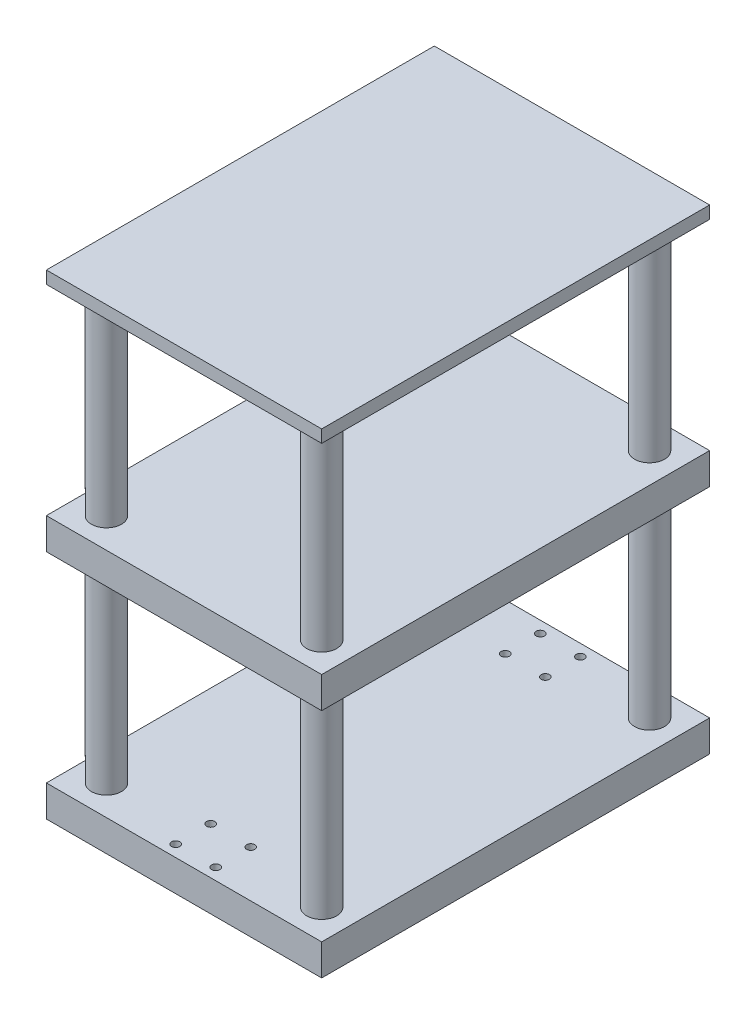
ISO-10303-21;
HEADER;
FILE_DESCRIPTION(('STEP AP214'),'2;1');
FILE_NAME('part.step','',(''),(''),'','','');
FILE_SCHEMA(('AUTOMOTIVE_DESIGN { 1 0 10303 214 1 1 1 1 }'));
ENDSEC;
DATA;
#1=APPLICATION_CONTEXT('core data for automotive mechanical design processes');
#2=APPLICATION_PROTOCOL_DEFINITION('international standard','automotive_design',2000,#1);
#3=PRODUCT_CONTEXT('',#1,'mechanical');
#4=PRODUCT('Part','Part','',(#3));
#5=PRODUCT_RELATED_PRODUCT_CATEGORY('part','',(#4));
#6=PRODUCT_DEFINITION_FORMATION('','',#4);
#7=PRODUCT_DEFINITION_CONTEXT('part definition',#1,'design');
#8=PRODUCT_DEFINITION('design','',#6,#7);
#9=PRODUCT_DEFINITION_SHAPE('','',#8);
#10=(LENGTH_UNIT() NAMED_UNIT(*) SI_UNIT(.MILLI.,.METRE.));
#11=(NAMED_UNIT(*) PLANE_ANGLE_UNIT() SI_UNIT($,.RADIAN.));
#12=(NAMED_UNIT(*) SI_UNIT($,.STERADIAN.) SOLID_ANGLE_UNIT());
#13=UNCERTAINTY_MEASURE_WITH_UNIT(LENGTH_MEASURE(1.E-05),#10,'distance_accuracy_value','');
#14=(GEOMETRIC_REPRESENTATION_CONTEXT(3) GLOBAL_UNCERTAINTY_ASSIGNED_CONTEXT((#13)) GLOBAL_UNIT_ASSIGNED_CONTEXT((#10,
#11,#12)) REPRESENTATION_CONTEXT('',''));
#15=CARTESIAN_POINT('',(0.,0.,0.));
#16=DIRECTION('',(0.,0.,1.));
#17=DIRECTION('',(1.,0.,0.));
#18=AXIS2_PLACEMENT_3D('',#15,#16,#17);
#19=CARTESIAN_POINT('',(55.,-80.,-77.5));
#20=DIRECTION('',(-1.,0.,0.));
#21=DIRECTION('',(0.,0.,1.));
#22=AXIS2_PLACEMENT_3D('',#19,#20,#21);
#23=PLANE('',#22);
#24=DIRECTION('',(0.,0.,-1.));
#25=VECTOR('',#24,1.);
#26=CARTESIAN_POINT('',(55.,-92.5,-77.5));
#27=LINE('',#26,#25);
#28=CARTESIAN_POINT('',(55.,-92.5,77.5));
#29=VERTEX_POINT('',#28);
#30=CARTESIAN_POINT('',(55.,-92.5,-77.5));
#31=VERTEX_POINT('',#30);
#32=EDGE_CURVE('E132',#29,#31,#27,.T.);
#33=ORIENTED_EDGE('',*,*,#32,.T.);
#34=DIRECTION('',(0.,-1.,0.));
#35=VECTOR('',#34,1.);
#36=CARTESIAN_POINT('',(55.,-80.,-77.5));
#37=LINE('',#36,#35);
#38=CARTESIAN_POINT('',(55.,-80.,-77.5));
#39=VERTEX_POINT('',#38);
#40=EDGE_CURVE('E123',#39,#31,#37,.T.);
#41=ORIENTED_EDGE('',*,*,#40,.F.);
#42=DIRECTION('',(0.,0.,-1.));
#43=VECTOR('',#42,1.);
#44=CARTESIAN_POINT('',(55.,-80.,-77.5));
#45=LINE('',#44,#43);
#46=CARTESIAN_POINT('',(55.,-80.,77.5));
#47=VERTEX_POINT('',#46);
#48=EDGE_CURVE('E117',#47,#39,#45,.T.);
#49=ORIENTED_EDGE('',*,*,#48,.F.);
#50=DIRECTION('',(0.,-1.,0.));
#51=VECTOR('',#50,1.);
#52=CARTESIAN_POINT('',(55.,-80.,77.5));
#53=LINE('',#52,#51);
#54=EDGE_CURVE('E128',#47,#29,#53,.T.);
#55=ORIENTED_EDGE('',*,*,#54,.T.);
#56=EDGE_LOOP('',(#33,#41,#49,#55));
#57=FACE_BOUND('',#56,.T.);
#58=ADVANCED_FACE('F62',(#57),#23,.F.);
#59=CARTESIAN_POINT('',(-55.,-80.,-77.5));
#60=DIRECTION('',(0.,0.,1.));
#61=DIRECTION('',(1.,0.,0.));
#62=AXIS2_PLACEMENT_3D('',#59,#60,#61);
#63=PLANE('',#62);
#64=DIRECTION('',(-1.,0.,0.));
#65=VECTOR('',#64,1.);
#66=CARTESIAN_POINT('',(-55.,-92.5,-77.5));
#67=LINE('',#66,#65);
#68=CARTESIAN_POINT('',(-55.,-92.5,-77.5));
#69=VERTEX_POINT('',#68);
#70=EDGE_CURVE('E122',#31,#69,#67,.T.);
#71=ORIENTED_EDGE('',*,*,#70,.T.);
#72=DIRECTION('',(0.,-1.,0.));
#73=VECTOR('',#72,1.);
#74=CARTESIAN_POINT('',(-55.,-80.,-77.5));
#75=LINE('',#74,#73);
#76=CARTESIAN_POINT('',(-55.,-80.,-77.5));
#77=VERTEX_POINT('',#76);
#78=EDGE_CURVE('E120',#77,#69,#75,.T.);
#79=ORIENTED_EDGE('',*,*,#78,.F.);
#80=DIRECTION('',(-1.,0.,0.));
#81=VECTOR('',#80,1.);
#82=CARTESIAN_POINT('',(-55.,-80.,-77.5));
#83=LINE('',#82,#81);
#84=EDGE_CURVE('E112',#39,#77,#83,.T.);
#85=ORIENTED_EDGE('',*,*,#84,.F.);
#86=ORIENTED_EDGE('',*,*,#40,.T.);
#87=EDGE_LOOP('',(#71,#79,#85,#86));
#88=FACE_BOUND('',#87,.T.);
#89=ADVANCED_FACE('F121',(#88),#63,.F.);
#90=CARTESIAN_POINT('',(-55.,-80.,-77.5));
#91=DIRECTION('',(1.,0.,0.));
#92=DIRECTION('',(0.,0.,-1.));
#93=AXIS2_PLACEMENT_3D('',#90,#91,#92);
#94=PLANE('',#93);
#95=DIRECTION('',(0.,0.,1.));
#96=VECTOR('',#95,1.);
#97=CARTESIAN_POINT('',(-55.,-92.5,-77.5));
#98=LINE('',#97,#96);
#99=CARTESIAN_POINT('',(-55.,-92.5,77.5));
#100=VERTEX_POINT('',#99);
#101=EDGE_CURVE('E98',#69,#100,#98,.T.);
#102=ORIENTED_EDGE('',*,*,#101,.T.);
#103=DIRECTION('',(0.,-1.,0.));
#104=VECTOR('',#103,1.);
#105=CARTESIAN_POINT('',(-55.,-80.,77.5));
#106=LINE('',#105,#104);
#107=CARTESIAN_POINT('',(-55.,-80.,77.5));
#108=VERTEX_POINT('',#107);
#109=EDGE_CURVE('E124',#108,#100,#106,.T.);
#110=ORIENTED_EDGE('',*,*,#109,.F.);
#111=DIRECTION('',(0.,0.,1.));
#112=VECTOR('',#111,1.);
#113=CARTESIAN_POINT('',(-55.,-80.,-77.5));
#114=LINE('',#113,#112);
#115=EDGE_CURVE('E115',#77,#108,#114,.T.);
#116=ORIENTED_EDGE('',*,*,#115,.F.);
#117=ORIENTED_EDGE('',*,*,#78,.T.);
#118=EDGE_LOOP('',(#102,#110,#116,#117));
#119=FACE_BOUND('',#118,.T.);
#120=ADVANCED_FACE('F126',(#119),#94,.F.);
#121=CARTESIAN_POINT('',(-55.,-80.,77.5));
#122=DIRECTION('',(0.,0.,-1.));
#123=DIRECTION('',(-1.,0.,0.));
#124=AXIS2_PLACEMENT_3D('',#121,#122,#123);
#125=PLANE('',#124);
#126=DIRECTION('',(1.,0.,0.));
#127=VECTOR('',#126,1.);
#128=CARTESIAN_POINT('',(-55.,-92.5,77.5));
#129=LINE('',#128,#127);
#130=EDGE_CURVE('E104',#100,#29,#129,.T.);
#131=ORIENTED_EDGE('',*,*,#130,.T.);
#132=ORIENTED_EDGE('',*,*,#54,.F.);
#133=DIRECTION('',(1.,0.,0.));
#134=VECTOR('',#133,1.);
#135=CARTESIAN_POINT('',(-55.,-80.,77.5));
#136=LINE('',#135,#134);
#137=EDGE_CURVE('E81',#108,#47,#136,.T.);
#138=ORIENTED_EDGE('',*,*,#137,.F.);
#139=ORIENTED_EDGE('',*,*,#109,.T.);
#140=EDGE_LOOP('',(#131,#132,#138,#139));
#141=FACE_BOUND('',#140,.T.);
#142=ADVANCED_FACE('F203',(#141),#125,.F.);
#143=CARTESIAN_POINT('',(0.,-80.,0.));
#144=DIRECTION('',(0.,1.,0.));
#145=DIRECTION('',(0.,0.,1.));
#146=AXIS2_PLACEMENT_3D('',#143,#144,#145);
#147=PLANE('',#146);
#148=CARTESIAN_POINT('',(8.,-80.,-58.85));
#149=DIRECTION('',(0.,1.,0.));
#150=DIRECTION('',(0.,0.,1.));
#151=AXIS2_PLACEMENT_3D('',#148,#149,#150);
#152=CIRCLE('',#151,1.64999999999999);
#153=CARTESIAN_POINT('',(8.,-80.,-57.2));
#154=VERTEX_POINT('',#153);
#155=EDGE_CURVE('E422',#154,#154,#152,.T.);
#156=ORIENTED_EDGE('',*,*,#155,.F.);
#157=EDGE_LOOP('',(#156));
#158=FACE_BOUND('',#157,.T.);
#159=CARTESIAN_POINT('',(-8.,-80.,-58.85));
#160=DIRECTION('',(0.,1.,0.));
#161=DIRECTION('',(0.,0.,1.));
#162=AXIS2_PLACEMENT_3D('',#159,#160,#161);
#163=CIRCLE('',#162,1.64999999999999);
#164=CARTESIAN_POINT('',(-8.,-80.,-57.2));
#165=VERTEX_POINT('',#164);
#166=EDGE_CURVE('E65',#165,#165,#163,.T.);
#167=ORIENTED_EDGE('',*,*,#166,.F.);
#168=EDGE_LOOP('',(#167));
#169=FACE_BOUND('',#168,.T.);
#170=CARTESIAN_POINT('',(8.,-80.,-72.85));
#171=DIRECTION('',(0.,1.,0.));
#172=DIRECTION('',(0.,0.,1.));
#173=AXIS2_PLACEMENT_3D('',#170,#171,#172);
#174=CIRCLE('',#173,1.64999999999999);
#175=CARTESIAN_POINT('',(8.,-80.,-71.2));
#176=VERTEX_POINT('',#175);
#177=EDGE_CURVE('E437',#176,#176,#174,.T.);
#178=ORIENTED_EDGE('',*,*,#177,.F.);
#179=EDGE_LOOP('',(#178));
#180=FACE_BOUND('',#179,.T.);
#181=CARTESIAN_POINT('',(-8.,-80.,-72.85));
#182=DIRECTION('',(0.,1.,0.));
#183=DIRECTION('',(0.,0.,1.));
#184=AXIS2_PLACEMENT_3D('',#181,#182,#183);
#185=CIRCLE('',#184,1.64999999999999);
#186=CARTESIAN_POINT('',(-8.,-80.,-71.2));
#187=VERTEX_POINT('',#186);
#188=EDGE_CURVE('E161',#187,#187,#185,.T.);
#189=ORIENTED_EDGE('',*,*,#188,.F.);
#190=EDGE_LOOP('',(#189));
#191=FACE_BOUND('',#190,.T.);
#192=CARTESIAN_POINT('',(-8.,-80.,58.85));
#193=DIRECTION('',(0.,1.,0.));
#194=DIRECTION('',(0.,0.,1.));
#195=AXIS2_PLACEMENT_3D('',#192,#193,#194);
#196=CIRCLE('',#195,1.64999999999999);
#197=CARTESIAN_POINT('',(-8.,-80.,60.5));
#198=VERTEX_POINT('',#197);
#199=EDGE_CURVE('E154',#198,#198,#196,.T.);
#200=ORIENTED_EDGE('',*,*,#199,.F.);
#201=EDGE_LOOP('',(#200));
#202=FACE_BOUND('',#201,.T.);
#203=CARTESIAN_POINT('',(8.,-80.,58.85));
#204=DIRECTION('',(0.,1.,0.));
#205=DIRECTION('',(0.,0.,1.));
#206=AXIS2_PLACEMENT_3D('',#203,#204,#205);
#207=CIRCLE('',#206,1.64999999999999);
#208=CARTESIAN_POINT('',(8.,-80.,60.5));
#209=VERTEX_POINT('',#208);
#210=EDGE_CURVE('E165',#209,#209,#207,.T.);
#211=ORIENTED_EDGE('',*,*,#210,.F.);
#212=EDGE_LOOP('',(#211));
#213=FACE_BOUND('',#212,.T.);
#214=CARTESIAN_POINT('',(8.,-80.,72.85));
#215=DIRECTION('',(0.,1.,0.));
#216=DIRECTION('',(0.,0.,1.));
#217=AXIS2_PLACEMENT_3D('',#214,#215,#216);
#218=CIRCLE('',#217,1.64999999999999);
#219=CARTESIAN_POINT('',(8.,-80.,74.5));
#220=VERTEX_POINT('',#219);
#221=EDGE_CURVE('E175',#220,#220,#218,.T.);
#222=ORIENTED_EDGE('',*,*,#221,.F.);
#223=EDGE_LOOP('',(#222));
#224=FACE_BOUND('',#223,.T.);
#225=CARTESIAN_POINT('',(-8.,-80.,72.85));
#226=DIRECTION('',(0.,1.,0.));
#227=DIRECTION('',(0.,0.,1.));
#228=AXIS2_PLACEMENT_3D('',#225,#226,#227);
#229=CIRCLE('',#228,1.64999999999999);
#230=CARTESIAN_POINT('',(-8.,-80.,74.5));
#231=VERTEX_POINT('',#230);
#232=EDGE_CURVE('E143',#231,#231,#229,.T.);
#233=ORIENTED_EDGE('',*,*,#232,.F.);
#234=EDGE_LOOP('',(#233));
#235=FACE_BOUND('',#234,.T.);
#236=CARTESIAN_POINT('',(43.,-80.,65.5));
#237=DIRECTION('',(0.,1.,0.));
#238=DIRECTION('',(0.,0.,-1.));
#239=AXIS2_PLACEMENT_3D('',#236,#237,#238);
#240=CIRCLE('',#239,6.);
#241=CARTESIAN_POINT('',(43.,-80.,59.5));
#242=VERTEX_POINT('',#241);
#243=EDGE_CURVE('E147',#242,#242,#240,.T.);
#244=ORIENTED_EDGE('',*,*,#243,.F.);
#245=EDGE_LOOP('',(#244));
#246=FACE_BOUND('',#245,.T.);
#247=CARTESIAN_POINT('',(43.,-80.,-65.5));
#248=DIRECTION('',(0.,1.,0.));
#249=DIRECTION('',(0.,0.,1.));
#250=AXIS2_PLACEMENT_3D('',#247,#248,#249);
#251=CIRCLE('',#250,6.);
#252=CARTESIAN_POINT('',(43.,-80.,-59.5));
#253=VERTEX_POINT('',#252);
#254=EDGE_CURVE('E13',#253,#253,#251,.T.);
#255=ORIENTED_EDGE('',*,*,#254,.F.);
#256=EDGE_LOOP('',(#255));
#257=FACE_BOUND('',#256,.T.);
#258=CARTESIAN_POINT('',(-43.,-80.,65.5));
#259=DIRECTION('',(0.,1.,0.));
#260=DIRECTION('',(0.,0.,1.));
#261=AXIS2_PLACEMENT_3D('',#258,#259,#260);
#262=CIRCLE('',#261,6.);
#263=CARTESIAN_POINT('',(-43.,-80.,71.5));
#264=VERTEX_POINT('',#263);
#265=EDGE_CURVE('E72',#264,#264,#262,.T.);
#266=ORIENTED_EDGE('',*,*,#265,.F.);
#267=EDGE_LOOP('',(#266));
#268=FACE_BOUND('',#267,.T.);
#269=CARTESIAN_POINT('',(-43.,-80.,-65.5));
#270=DIRECTION('',(0.,1.,0.));
#271=DIRECTION('',(0.,0.,1.));
#272=AXIS2_PLACEMENT_3D('',#269,#270,#271);
#273=CIRCLE('',#272,6.);
#274=CARTESIAN_POINT('',(-43.,-80.,-59.5));
#275=VERTEX_POINT('',#274);
#276=EDGE_CURVE('E193',#275,#275,#273,.T.);
#277=ORIENTED_EDGE('',*,*,#276,.F.);
#278=EDGE_LOOP('',(#277));
#279=FACE_BOUND('',#278,.T.);
#280=ORIENTED_EDGE('',*,*,#48,.T.);
#281=ORIENTED_EDGE('',*,*,#84,.T.);
#282=ORIENTED_EDGE('',*,*,#115,.T.);
#283=ORIENTED_EDGE('',*,*,#137,.T.);
#284=EDGE_LOOP('',(#280,#281,#282,#283));
#285=FACE_BOUND('',#284,.T.);
#286=ADVANCED_FACE('F113',(#158,#169,#180,#191,#202,#213,#224,#235,#246,#257,#268,#279,#285),
#147,.T.);
#287=CARTESIAN_POINT('',(0.,-92.5,0.));
#288=DIRECTION('',(0.,1.,0.));
#289=DIRECTION('',(0.,0.,1.));
#290=AXIS2_PLACEMENT_3D('',#287,#288,#289);
#291=PLANE('',#290);
#292=CARTESIAN_POINT('',(8.,-92.5,-58.85));
#293=DIRECTION('',(0.,-1.,0.));
#294=DIRECTION('',(0.,0.,-1.));
#295=AXIS2_PLACEMENT_3D('',#292,#293,#294);
#296=CIRCLE('',#295,1.64999999999999);
#297=CARTESIAN_POINT('',(8.,-92.5,-60.5));
#298=VERTEX_POINT('',#297);
#299=EDGE_CURVE('E425',#298,#298,#296,.T.);
#300=ORIENTED_EDGE('',*,*,#299,.F.);
#301=EDGE_LOOP('',(#300));
#302=FACE_BOUND('',#301,.T.);
#303=CARTESIAN_POINT('',(-8.,-92.5,-58.85));
#304=DIRECTION('',(0.,-1.,0.));
#305=DIRECTION('',(0.,0.,-1.));
#306=AXIS2_PLACEMENT_3D('',#303,#304,#305);
#307=CIRCLE('',#306,1.64999999999999);
#308=CARTESIAN_POINT('',(-8.,-92.5,-60.5));
#309=VERTEX_POINT('',#308);
#310=EDGE_CURVE('E428',#309,#309,#307,.T.);
#311=ORIENTED_EDGE('',*,*,#310,.F.);
#312=EDGE_LOOP('',(#311));
#313=FACE_BOUND('',#312,.T.);
#314=CARTESIAN_POINT('',(8.,-92.5,-72.85));
#315=DIRECTION('',(0.,-1.,0.));
#316=DIRECTION('',(0.,0.,-1.));
#317=AXIS2_PLACEMENT_3D('',#314,#315,#316);
#318=CIRCLE('',#317,1.64999999999999);
#319=CARTESIAN_POINT('',(8.,-92.5,-74.5));
#320=VERTEX_POINT('',#319);
#321=EDGE_CURVE('E442',#320,#320,#318,.T.);
#322=ORIENTED_EDGE('',*,*,#321,.F.);
#323=EDGE_LOOP('',(#322));
#324=FACE_BOUND('',#323,.T.);
#325=CARTESIAN_POINT('',(-8.,-92.5,-72.85));
#326=DIRECTION('',(0.,-1.,0.));
#327=DIRECTION('',(0.,0.,-1.));
#328=AXIS2_PLACEMENT_3D('',#325,#326,#327);
#329=CIRCLE('',#328,1.64999999999999);
#330=CARTESIAN_POINT('',(-8.,-92.5,-74.5));
#331=VERTEX_POINT('',#330);
#332=EDGE_CURVE('E441',#331,#331,#329,.T.);
#333=ORIENTED_EDGE('',*,*,#332,.F.);
#334=EDGE_LOOP('',(#333));
#335=FACE_BOUND('',#334,.T.);
#336=CARTESIAN_POINT('',(-8.,-92.5,58.85));
#337=DIRECTION('',(0.,-1.,0.));
#338=DIRECTION('',(0.,0.,-1.));
#339=AXIS2_PLACEMENT_3D('',#336,#337,#338);
#340=CIRCLE('',#339,1.64999999999999);
#341=CARTESIAN_POINT('',(-8.,-92.5,57.2));
#342=VERTEX_POINT('',#341);
#343=EDGE_CURVE('E160',#342,#342,#340,.T.);
#344=ORIENTED_EDGE('',*,*,#343,.F.);
#345=EDGE_LOOP('',(#344));
#346=FACE_BOUND('',#345,.T.);
#347=CARTESIAN_POINT('',(8.,-92.5,58.85));
#348=DIRECTION('',(0.,-1.,0.));
#349=DIRECTION('',(0.,0.,-1.));
#350=AXIS2_PLACEMENT_3D('',#347,#348,#349);
#351=CIRCLE('',#350,1.64999999999999);
#352=CARTESIAN_POINT('',(8.,-92.5,57.2));
#353=VERTEX_POINT('',#352);
#354=EDGE_CURVE('E170',#353,#353,#351,.T.);
#355=ORIENTED_EDGE('',*,*,#354,.F.);
#356=EDGE_LOOP('',(#355));
#357=FACE_BOUND('',#356,.T.);
#358=CARTESIAN_POINT('',(8.,-92.5,72.85));
#359=DIRECTION('',(0.,-1.,0.));
#360=DIRECTION('',(0.,0.,-1.));
#361=AXIS2_PLACEMENT_3D('',#358,#359,#360);
#362=CIRCLE('',#361,1.64999999999999);
#363=CARTESIAN_POINT('',(8.,-92.5,71.2));
#364=VERTEX_POINT('',#363);
#365=EDGE_CURVE('E173',#364,#364,#362,.T.);
#366=ORIENTED_EDGE('',*,*,#365,.F.);
#367=EDGE_LOOP('',(#366));
#368=FACE_BOUND('',#367,.T.);
#369=CARTESIAN_POINT('',(-8.,-92.5,72.85));
#370=DIRECTION('',(0.,-1.,0.));
#371=DIRECTION('',(0.,0.,-1.));
#372=AXIS2_PLACEMENT_3D('',#369,#370,#371);
#373=CIRCLE('',#372,1.64999999999999);
#374=CARTESIAN_POINT('',(-8.,-92.5,71.2));
#375=VERTEX_POINT('',#374);
#376=EDGE_CURVE('E148',#375,#375,#373,.T.);
#377=ORIENTED_EDGE('',*,*,#376,.F.);
#378=EDGE_LOOP('',(#377));
#379=FACE_BOUND('',#378,.T.);
#380=ORIENTED_EDGE('',*,*,#32,.F.);
#381=ORIENTED_EDGE('',*,*,#130,.F.);
#382=ORIENTED_EDGE('',*,*,#101,.F.);
#383=ORIENTED_EDGE('',*,*,#70,.F.);
#384=EDGE_LOOP('',(#380,#381,#382,#383));
#385=FACE_BOUND('',#384,.T.);
#386=ADVANCED_FACE('F202',(#302,#313,#324,#335,#346,#357,#368,#379,#385),#291,.F.);
#387=CARTESIAN_POINT('',(-43.,0.,-65.5));
#388=DIRECTION('',(0.,-1.,0.));
#389=DIRECTION('',(0.,0.,-1.));
#390=AXIS2_PLACEMENT_3D('',#387,#388,#389);
#391=CYLINDRICAL_SURFACE('',#390,6.);
#392=CARTESIAN_POINT('',(-43.,0.,-65.5));
#393=DIRECTION('',(0.,1.,0.));
#394=DIRECTION('',(0.,0.,1.));
#395=AXIS2_PLACEMENT_3D('',#392,#393,#394);
#396=CIRCLE('',#395,6.);
#397=CARTESIAN_POINT('',(-43.,0.,-59.5));
#398=VERTEX_POINT('',#397);
#399=EDGE_CURVE('E135',#398,#398,#396,.T.);
#400=ORIENTED_EDGE('',*,*,#399,.F.);
#401=EDGE_LOOP('',(#400));
#402=FACE_BOUND('',#401,.T.);
#403=ORIENTED_EDGE('',*,*,#276,.T.);
#404=EDGE_LOOP('',(#403));
#405=FACE_BOUND('',#404,.T.);
#406=ADVANCED_FACE('F199',(#402,#405),#391,.T.);
#407=CARTESIAN_POINT('',(-43.,0.,-65.5));
#408=DIRECTION('',(0.,1.,0.));
#409=DIRECTION('',(0.,0.,1.));
#410=AXIS2_PLACEMENT_3D('',#407,#408,#409);
#411=PLANE('',#410);
#412=ORIENTED_EDGE('',*,*,#399,.T.);
#413=EDGE_LOOP('',(#412));
#414=FACE_BOUND('',#413,.T.);
#415=ADVANCED_FACE('F242',(#414),#411,.T.);
#416=CARTESIAN_POINT('',(-43.,0.,65.5));
#417=DIRECTION('',(0.,-1.,0.));
#418=DIRECTION('',(0.,0.,-1.));
#419=AXIS2_PLACEMENT_3D('',#416,#417,#418);
#420=CYLINDRICAL_SURFACE('',#419,6.);
#421=CARTESIAN_POINT('',(-43.,0.,65.5));
#422=DIRECTION('',(0.,-1.,0.));
#423=DIRECTION('',(0.,0.,-1.));
#424=AXIS2_PLACEMENT_3D('',#421,#422,#423);
#425=CIRCLE('',#424,6.);
#426=CARTESIAN_POINT('',(-43.,0.,59.5));
#427=VERTEX_POINT('',#426);
#428=EDGE_CURVE('E190',#427,#427,#425,.T.);
#429=ORIENTED_EDGE('',*,*,#428,.T.);
#430=EDGE_LOOP('',(#429));
#431=FACE_BOUND('',#430,.T.);
#432=ORIENTED_EDGE('',*,*,#265,.T.);
#433=EDGE_LOOP('',(#432));
#434=FACE_BOUND('',#433,.T.);
#435=ADVANCED_FACE('F251',(#431,#434),#420,.T.);
#436=CARTESIAN_POINT('',(-43.,0.,65.5));
#437=DIRECTION('',(0.,1.,0.));
#438=DIRECTION('',(0.,0.,-1.));
#439=AXIS2_PLACEMENT_3D('',#436,#437,#438);
#440=PLANE('',#439);
#441=ORIENTED_EDGE('',*,*,#428,.F.);
#442=EDGE_LOOP('',(#441));
#443=FACE_BOUND('',#442,.T.);
#444=ADVANCED_FACE('F261',(#443),#440,.T.);
#445=CARTESIAN_POINT('',(43.,0.,-65.5));
#446=DIRECTION('',(0.,-1.,0.));
#447=DIRECTION('',(0.,0.,-1.));
#448=AXIS2_PLACEMENT_3D('',#445,#446,#447);
#449=CYLINDRICAL_SURFACE('',#448,6.);
#450=CARTESIAN_POINT('',(43.,0.,-65.5));
#451=DIRECTION('',(0.,-1.,0.));
#452=DIRECTION('',(0.,0.,1.));
#453=AXIS2_PLACEMENT_3D('',#450,#451,#452);
#454=CIRCLE('',#453,6.);
#455=CARTESIAN_POINT('',(43.,0.,-59.5));
#456=VERTEX_POINT('',#455);
#457=EDGE_CURVE('E185',#456,#456,#454,.T.);
#458=ORIENTED_EDGE('',*,*,#457,.T.);
#459=EDGE_LOOP('',(#458));
#460=FACE_BOUND('',#459,.T.);
#461=ORIENTED_EDGE('',*,*,#254,.T.);
#462=EDGE_LOOP('',(#461));
#463=FACE_BOUND('',#462,.T.);
#464=ADVANCED_FACE('F270',(#460,#463),#449,.T.);
#465=CARTESIAN_POINT('',(43.,0.,-65.5));
#466=DIRECTION('',(0.,1.,0.));
#467=DIRECTION('',(0.,0.,1.));
#468=AXIS2_PLACEMENT_3D('',#465,#466,#467);
#469=PLANE('',#468);
#470=ORIENTED_EDGE('',*,*,#457,.F.);
#471=EDGE_LOOP('',(#470));
#472=FACE_BOUND('',#471,.T.);
#473=ADVANCED_FACE('F280',(#472),#469,.T.);
#474=CARTESIAN_POINT('',(43.,0.,65.5));
#475=DIRECTION('',(0.,-1.,0.));
#476=DIRECTION('',(0.,0.,-1.));
#477=AXIS2_PLACEMENT_3D('',#474,#475,#476);
#478=CYLINDRICAL_SURFACE('',#477,6.);
#479=CARTESIAN_POINT('',(43.,0.,65.5));
#480=DIRECTION('',(0.,1.,0.));
#481=DIRECTION('',(0.,0.,-1.));
#482=AXIS2_PLACEMENT_3D('',#479,#480,#481);
#483=CIRCLE('',#482,6.);
#484=CARTESIAN_POINT('',(43.,0.,59.5));
#485=VERTEX_POINT('',#484);
#486=EDGE_CURVE('E182',#485,#485,#483,.T.);
#487=ORIENTED_EDGE('',*,*,#486,.F.);
#488=EDGE_LOOP('',(#487));
#489=FACE_BOUND('',#488,.T.);
#490=ORIENTED_EDGE('',*,*,#243,.T.);
#491=EDGE_LOOP('',(#490));
#492=FACE_BOUND('',#491,.T.);
#493=ADVANCED_FACE('F289',(#489,#492),#478,.T.);
#494=CARTESIAN_POINT('',(43.,0.,65.5));
#495=DIRECTION('',(0.,1.,0.));
#496=DIRECTION('',(0.,0.,-1.));
#497=AXIS2_PLACEMENT_3D('',#494,#495,#496);
#498=PLANE('',#497);
#499=ORIENTED_EDGE('',*,*,#486,.T.);
#500=EDGE_LOOP('',(#499));
#501=FACE_BOUND('',#500,.T.);
#502=ADVANCED_FACE('F299',(#501),#498,.T.);
#503=CARTESIAN_POINT('',(-8.,-92.5,72.85));
#504=DIRECTION('',(0.,-1.,0.));
#505=DIRECTION('',(0.,0.,-1.));
#506=AXIS2_PLACEMENT_3D('',#503,#504,#505);
#507=CYLINDRICAL_SURFACE('',#506,1.64999999999999);
#508=ORIENTED_EDGE('',*,*,#232,.T.);
#509=EDGE_LOOP('',(#508));
#510=FACE_BOUND('',#509,.T.);
#511=ORIENTED_EDGE('',*,*,#376,.T.);
#512=EDGE_LOOP('',(#511));
#513=FACE_BOUND('',#512,.T.);
#514=ADVANCED_FACE('F308',(#510,#513),#507,.F.);
#515=CARTESIAN_POINT('',(8.,-92.5,72.85));
#516=DIRECTION('',(0.,-1.,0.));
#517=DIRECTION('',(0.,0.,-1.));
#518=AXIS2_PLACEMENT_3D('',#515,#516,#517);
#519=CYLINDRICAL_SURFACE('',#518,1.64999999999999);
#520=ORIENTED_EDGE('',*,*,#221,.T.);
#521=EDGE_LOOP('',(#520));
#522=FACE_BOUND('',#521,.T.);
#523=ORIENTED_EDGE('',*,*,#365,.T.);
#524=EDGE_LOOP('',(#523));
#525=FACE_BOUND('',#524,.T.);
#526=ADVANCED_FACE('F317',(#522,#525),#519,.F.);
#527=CARTESIAN_POINT('',(8.,-92.5,58.85));
#528=DIRECTION('',(0.,-1.,0.));
#529=DIRECTION('',(0.,0.,-1.));
#530=AXIS2_PLACEMENT_3D('',#527,#528,#529);
#531=CYLINDRICAL_SURFACE('',#530,1.64999999999999);
#532=ORIENTED_EDGE('',*,*,#210,.T.);
#533=EDGE_LOOP('',(#532));
#534=FACE_BOUND('',#533,.T.);
#535=ORIENTED_EDGE('',*,*,#354,.T.);
#536=EDGE_LOOP('',(#535));
#537=FACE_BOUND('',#536,.T.);
#538=ADVANCED_FACE('F326',(#534,#537),#531,.F.);
#539=CARTESIAN_POINT('',(-8.,-92.5,58.85));
#540=DIRECTION('',(0.,-1.,0.));
#541=DIRECTION('',(0.,0.,-1.));
#542=AXIS2_PLACEMENT_3D('',#539,#540,#541);
#543=CYLINDRICAL_SURFACE('',#542,1.64999999999999);
#544=ORIENTED_EDGE('',*,*,#199,.T.);
#545=EDGE_LOOP('',(#544));
#546=FACE_BOUND('',#545,.T.);
#547=ORIENTED_EDGE('',*,*,#343,.T.);
#548=EDGE_LOOP('',(#547));
#549=FACE_BOUND('',#548,.T.);
#550=ADVANCED_FACE('F335',(#546,#549),#543,.F.);
#551=CARTESIAN_POINT('',(-8.,-92.5,-72.85));
#552=DIRECTION('',(0.,-1.,0.));
#553=DIRECTION('',(0.,0.,-1.));
#554=AXIS2_PLACEMENT_3D('',#551,#552,#553);
#555=CYLINDRICAL_SURFACE('',#554,1.64999999999999);
#556=ORIENTED_EDGE('',*,*,#188,.T.);
#557=EDGE_LOOP('',(#556));
#558=FACE_BOUND('',#557,.T.);
#559=ORIENTED_EDGE('',*,*,#332,.T.);
#560=EDGE_LOOP('',(#559));
#561=FACE_BOUND('',#560,.T.);
#562=ADVANCED_FACE('F343',(#558,#561),#555,.F.);
#563=CARTESIAN_POINT('',(8.,-92.5,-72.85));
#564=DIRECTION('',(0.,-1.,0.));
#565=DIRECTION('',(0.,0.,-1.));
#566=AXIS2_PLACEMENT_3D('',#563,#564,#565);
#567=CYLINDRICAL_SURFACE('',#566,1.64999999999999);
#568=ORIENTED_EDGE('',*,*,#177,.T.);
#569=EDGE_LOOP('',(#568));
#570=FACE_BOUND('',#569,.T.);
#571=ORIENTED_EDGE('',*,*,#321,.T.);
#572=EDGE_LOOP('',(#571));
#573=FACE_BOUND('',#572,.T.);
#574=ADVANCED_FACE('F361',(#570,#573),#567,.F.);
#575=CARTESIAN_POINT('',(-8.,-92.5,-58.85));
#576=DIRECTION('',(0.,-1.,0.));
#577=DIRECTION('',(0.,0.,-1.));
#578=AXIS2_PLACEMENT_3D('',#575,#576,#577);
#579=CYLINDRICAL_SURFACE('',#578,1.64999999999999);
#580=ORIENTED_EDGE('',*,*,#166,.T.);
#581=EDGE_LOOP('',(#580));
#582=FACE_BOUND('',#581,.T.);
#583=ORIENTED_EDGE('',*,*,#310,.T.);
#584=EDGE_LOOP('',(#583));
#585=FACE_BOUND('',#584,.T.);
#586=ADVANCED_FACE('F370',(#582,#585),#579,.F.);
#587=CARTESIAN_POINT('',(8.,-92.5,-58.85));
#588=DIRECTION('',(0.,-1.,0.));
#589=DIRECTION('',(0.,0.,-1.));
#590=AXIS2_PLACEMENT_3D('',#587,#588,#589);
#591=CYLINDRICAL_SURFACE('',#590,1.64999999999999);
#592=ORIENTED_EDGE('',*,*,#155,.T.);
#593=EDGE_LOOP('',(#592));
#594=FACE_BOUND('',#593,.T.);
#595=ORIENTED_EDGE('',*,*,#299,.T.);
#596=EDGE_LOOP('',(#595));
#597=FACE_BOUND('',#596,.T.);
#598=ADVANCED_FACE('F379',(#594,#597),#591,.F.);
#599=CLOSED_SHELL('',(#58,#89,#120,#142,#286,#386,#406,#415,#435,#444,#464,#473,#493,#502,#514,
#526,#538,#550,#562,#574,#586,#598));
#600=MANIFOLD_SOLID_BREP('B2',#599);
#601=CARTESIAN_POINT('',(55.,12.5,-77.5));
#602=DIRECTION('',(-1.,0.,0.));
#603=DIRECTION('',(0.,0.,1.));
#604=AXIS2_PLACEMENT_3D('',#601,#602,#603);
#605=PLANE('',#604);
#606=DIRECTION('',(0.,0.,-1.));
#607=VECTOR('',#606,1.);
#608=CARTESIAN_POINT('',(55.,0.,-77.5));
#609=LINE('',#608,#607);
#610=CARTESIAN_POINT('',(55.,0.,77.5));
#611=VERTEX_POINT('',#610);
#612=CARTESIAN_POINT('',(55.,0.,-77.5));
#613=VERTEX_POINT('',#612);
#614=EDGE_CURVE('E621',#611,#613,#609,.T.);
#615=ORIENTED_EDGE('',*,*,#614,.T.);
#616=DIRECTION('',(0.,-1.,0.));
#617=VECTOR('',#616,1.);
#618=CARTESIAN_POINT('',(55.,12.5,-77.5));
#619=LINE('',#618,#617);
#620=CARTESIAN_POINT('',(55.,12.5,-77.5));
#621=VERTEX_POINT('',#620);
#622=EDGE_CURVE('E642',#621,#613,#619,.T.);
#623=ORIENTED_EDGE('',*,*,#622,.F.);
#624=DIRECTION('',(0.,0.,-1.));
#625=VECTOR('',#624,1.);
#626=CARTESIAN_POINT('',(55.,12.5,-77.5));
#627=LINE('',#626,#625);
#628=CARTESIAN_POINT('',(55.,12.5,77.5));
#629=VERTEX_POINT('',#628);
#630=EDGE_CURVE('E624',#629,#621,#627,.T.);
#631=ORIENTED_EDGE('',*,*,#630,.F.);
#632=DIRECTION('',(0.,-1.,0.));
#633=VECTOR('',#632,1.);
#634=CARTESIAN_POINT('',(55.,12.5,77.5));
#635=LINE('',#634,#633);
#636=EDGE_CURVE('E630',#629,#611,#635,.T.);
#637=ORIENTED_EDGE('',*,*,#636,.T.);
#638=EDGE_LOOP('',(#615,#623,#631,#637));
#639=FACE_BOUND('',#638,.T.);
#640=ADVANCED_FACE('F500',(#639),#605,.F.);
#641=CARTESIAN_POINT('',(-55.,12.5,-77.5));
#642=DIRECTION('',(0.,0.,1.));
#643=DIRECTION('',(1.,0.,0.));
#644=AXIS2_PLACEMENT_3D('',#641,#642,#643);
#645=PLANE('',#644);
#646=DIRECTION('',(-1.,0.,0.));
#647=VECTOR('',#646,1.);
#648=CARTESIAN_POINT('',(-55.,0.,-77.5));
#649=LINE('',#648,#647);
#650=CARTESIAN_POINT('',(-55.,0.,-77.5));
#651=VERTEX_POINT('',#650);
#652=EDGE_CURVE('E633',#613,#651,#649,.T.);
#653=ORIENTED_EDGE('',*,*,#652,.T.);
#654=DIRECTION('',(0.,-1.,0.));
#655=VECTOR('',#654,1.);
#656=CARTESIAN_POINT('',(-55.,12.5,-77.5));
#657=LINE('',#656,#655);
#658=CARTESIAN_POINT('',(-55.,12.5,-77.5));
#659=VERTEX_POINT('',#658);
#660=EDGE_CURVE('E640',#659,#651,#657,.T.);
#661=ORIENTED_EDGE('',*,*,#660,.F.);
#662=DIRECTION('',(-1.,0.,0.));
#663=VECTOR('',#662,1.);
#664=CARTESIAN_POINT('',(-55.,12.5,-77.5));
#665=LINE('',#664,#663);
#666=EDGE_CURVE('E548',#621,#659,#665,.T.);
#667=ORIENTED_EDGE('',*,*,#666,.F.);
#668=ORIENTED_EDGE('',*,*,#622,.T.);
#669=EDGE_LOOP('',(#653,#661,#667,#668));
#670=FACE_BOUND('',#669,.T.);
#671=ADVANCED_FACE('F660',(#670),#645,.F.);
#672=CARTESIAN_POINT('',(-55.,12.5,-77.5));
#673=DIRECTION('',(1.,0.,0.));
#674=DIRECTION('',(0.,0.,-1.));
#675=AXIS2_PLACEMENT_3D('',#672,#673,#674);
#676=PLANE('',#675);
#677=DIRECTION('',(0.,0.,1.));
#678=VECTOR('',#677,1.);
#679=CARTESIAN_POINT('',(-55.,0.,-77.5));
#680=LINE('',#679,#678);
#681=CARTESIAN_POINT('',(-55.,0.,77.5));
#682=VERTEX_POINT('',#681);
#683=EDGE_CURVE('E534',#651,#682,#680,.T.);
#684=ORIENTED_EDGE('',*,*,#683,.T.);
#685=DIRECTION('',(0.,-1.,0.));
#686=VECTOR('',#685,1.);
#687=CARTESIAN_POINT('',(-55.,12.5,77.5));
#688=LINE('',#687,#686);
#689=CARTESIAN_POINT('',(-55.,12.5,77.5));
#690=VERTEX_POINT('',#689);
#691=EDGE_CURVE('E638',#690,#682,#688,.T.);
#692=ORIENTED_EDGE('',*,*,#691,.F.);
#693=DIRECTION('',(0.,0.,1.));
#694=VECTOR('',#693,1.);
#695=CARTESIAN_POINT('',(-55.,12.5,-77.5));
#696=LINE('',#695,#694);
#697=EDGE_CURVE('E627',#659,#690,#696,.T.);
#698=ORIENTED_EDGE('',*,*,#697,.F.);
#699=ORIENTED_EDGE('',*,*,#660,.T.);
#700=EDGE_LOOP('',(#684,#692,#698,#699));
#701=FACE_BOUND('',#700,.T.);
#702=ADVANCED_FACE('F663',(#701),#676,.F.);
#703=CARTESIAN_POINT('',(-55.,12.5,77.5));
#704=DIRECTION('',(0.,0.,-1.));
#705=DIRECTION('',(-1.,0.,0.));
#706=AXIS2_PLACEMENT_3D('',#703,#704,#705);
#707=PLANE('',#706);
#708=DIRECTION('',(1.,0.,0.));
#709=VECTOR('',#708,1.);
#710=CARTESIAN_POINT('',(-55.,0.,77.5));
#711=LINE('',#710,#709);
#712=EDGE_CURVE('E540',#682,#611,#711,.T.);
#713=ORIENTED_EDGE('',*,*,#712,.T.);
#714=ORIENTED_EDGE('',*,*,#636,.F.);
#715=DIRECTION('',(1.,0.,0.));
#716=VECTOR('',#715,1.);
#717=CARTESIAN_POINT('',(-55.,12.5,77.5));
#718=LINE('',#717,#716);
#719=EDGE_CURVE('E516',#690,#629,#718,.T.);
#720=ORIENTED_EDGE('',*,*,#719,.F.);
#721=ORIENTED_EDGE('',*,*,#691,.T.);
#722=EDGE_LOOP('',(#713,#714,#720,#721));
#723=FACE_BOUND('',#722,.T.);
#724=ADVANCED_FACE('F652',(#723),#707,.F.);
#725=CARTESIAN_POINT('',(0.,12.5,0.));
#726=DIRECTION('',(0.,1.,0.));
#727=DIRECTION('',(0.,0.,1.));
#728=AXIS2_PLACEMENT_3D('',#725,#726,#727);
#729=PLANE('',#728);
#730=CARTESIAN_POINT('',(43.,12.5,65.5));
#731=DIRECTION('',(0.,1.,0.));
#732=DIRECTION('',(0.,0.,-1.));
#733=AXIS2_PLACEMENT_3D('',#730,#731,#732);
#734=CIRCLE('',#733,6.);
#735=CARTESIAN_POINT('',(43.,12.5,59.5));
#736=VERTEX_POINT('',#735);
#737=EDGE_CURVE('E613',#736,#736,#734,.T.);
#738=ORIENTED_EDGE('',*,*,#737,.F.);
#739=EDGE_LOOP('',(#738));
#740=FACE_BOUND('',#739,.T.);
#741=CARTESIAN_POINT('',(43.,12.5,-65.5));
#742=DIRECTION('',(0.,1.,0.));
#743=DIRECTION('',(0.,0.,1.));
#744=AXIS2_PLACEMENT_3D('',#741,#742,#743);
#745=CIRCLE('',#744,6.);
#746=CARTESIAN_POINT('',(43.,12.5,-59.5));
#747=VERTEX_POINT('',#746);
#748=EDGE_CURVE('E60',#747,#747,#745,.T.);
#749=ORIENTED_EDGE('',*,*,#748,.F.);
#750=EDGE_LOOP('',(#749));
#751=FACE_BOUND('',#750,.T.);
#752=CARTESIAN_POINT('',(-43.,12.5,65.5));
#753=DIRECTION('',(0.,1.,0.));
#754=DIRECTION('',(0.,0.,1.));
#755=AXIS2_PLACEMENT_3D('',#752,#753,#754);
#756=CIRCLE('',#755,6.);
#757=CARTESIAN_POINT('',(-43.,12.5,71.5));
#758=VERTEX_POINT('',#757);
#759=EDGE_CURVE('E508',#758,#758,#756,.T.);
#760=ORIENTED_EDGE('',*,*,#759,.F.);
#761=EDGE_LOOP('',(#760));
#762=FACE_BOUND('',#761,.T.);
#763=CARTESIAN_POINT('',(-43.,12.5,-65.5));
#764=DIRECTION('',(0.,1.,0.));
#765=DIRECTION('',(0.,0.,1.));
#766=AXIS2_PLACEMENT_3D('',#763,#764,#765);
#767=CIRCLE('',#766,6.);
#768=CARTESIAN_POINT('',(-43.,12.5,-59.5));
#769=VERTEX_POINT('',#768);
#770=EDGE_CURVE('E612',#769,#769,#767,.T.);
#771=ORIENTED_EDGE('',*,*,#770,.F.);
#772=EDGE_LOOP('',(#771));
#773=FACE_BOUND('',#772,.T.);
#774=ORIENTED_EDGE('',*,*,#630,.T.);
#775=ORIENTED_EDGE('',*,*,#666,.T.);
#776=ORIENTED_EDGE('',*,*,#697,.T.);
#777=ORIENTED_EDGE('',*,*,#719,.T.);
#778=EDGE_LOOP('',(#774,#775,#776,#777));
#779=FACE_BOUND('',#778,.T.);
#780=ADVANCED_FACE('F648',(#740,#751,#762,#773,#779),#729,.T.);
#781=CARTESIAN_POINT('',(0.,0.,0.));
#782=DIRECTION('',(0.,1.,0.));
#783=DIRECTION('',(0.,0.,1.));
#784=AXIS2_PLACEMENT_3D('',#781,#782,#783);
#785=PLANE('',#784);
#786=ORIENTED_EDGE('',*,*,#614,.F.);
#787=ORIENTED_EDGE('',*,*,#712,.F.);
#788=ORIENTED_EDGE('',*,*,#683,.F.);
#789=ORIENTED_EDGE('',*,*,#652,.F.);
#790=EDGE_LOOP('',(#786,#787,#788,#789));
#791=FACE_BOUND('',#790,.T.);
#792=ADVANCED_FACE('F651',(#791),#785,.F.);
#793=CARTESIAN_POINT('',(-43.,92.5,-65.5));
#794=DIRECTION('',(0.,-1.,0.));
#795=DIRECTION('',(0.,0.,-1.));
#796=AXIS2_PLACEMENT_3D('',#793,#794,#795);
#797=CYLINDRICAL_SURFACE('',#796,6.);
#798=CARTESIAN_POINT('',(-43.,92.5,-65.5));
#799=DIRECTION('',(0.,1.,0.));
#800=DIRECTION('',(0.,0.,1.));
#801=AXIS2_PLACEMENT_3D('',#798,#799,#800);
#802=CIRCLE('',#801,6.);
#803=CARTESIAN_POINT('',(-43.,92.5,-59.5));
#804=VERTEX_POINT('',#803);
#805=EDGE_CURVE('E618',#804,#804,#802,.T.);
#806=ORIENTED_EDGE('',*,*,#805,.F.);
#807=EDGE_LOOP('',(#806));
#808=FACE_BOUND('',#807,.T.);
#809=ORIENTED_EDGE('',*,*,#770,.T.);
#810=EDGE_LOOP('',(#809));
#811=FACE_BOUND('',#810,.T.);
#812=ADVANCED_FACE('F665',(#808,#811),#797,.T.);
#813=CARTESIAN_POINT('',(-43.,92.5,65.5));
#814=DIRECTION('',(0.,-1.,0.));
#815=DIRECTION('',(0.,0.,-1.));
#816=AXIS2_PLACEMENT_3D('',#813,#814,#815);
#817=CYLINDRICAL_SURFACE('',#816,6.);
#818=CARTESIAN_POINT('',(-43.,92.5,65.5));
#819=DIRECTION('',(0.,-1.,0.));
#820=DIRECTION('',(0.,0.,-1.));
#821=AXIS2_PLACEMENT_3D('',#818,#819,#820);
#822=CIRCLE('',#821,6.);
#823=CARTESIAN_POINT('',(-43.,92.5,59.5));
#824=VERTEX_POINT('',#823);
#825=EDGE_CURVE('E603',#824,#824,#822,.T.);
#826=ORIENTED_EDGE('',*,*,#825,.T.);
#827=EDGE_LOOP('',(#826));
#828=FACE_BOUND('',#827,.T.);
#829=ORIENTED_EDGE('',*,*,#759,.T.);
#830=EDGE_LOOP('',(#829));
#831=FACE_BOUND('',#830,.T.);
#832=ADVANCED_FACE('F646',(#828,#831),#817,.T.);
#833=CARTESIAN_POINT('',(43.,92.5,-65.5));
#834=DIRECTION('',(0.,-1.,0.));
#835=DIRECTION('',(0.,0.,-1.));
#836=AXIS2_PLACEMENT_3D('',#833,#834,#835);
#837=CYLINDRICAL_SURFACE('',#836,6.);
#838=CARTESIAN_POINT('',(43.,92.5,-65.5));
#839=DIRECTION('',(0.,-1.,0.));
#840=DIRECTION('',(0.,0.,1.));
#841=AXIS2_PLACEMENT_3D('',#838,#839,#840);
#842=CIRCLE('',#841,6.);
#843=CARTESIAN_POINT('',(43.,92.5,-59.5));
#844=VERTEX_POINT('',#843);
#845=EDGE_CURVE('E600',#844,#844,#842,.T.);
#846=ORIENTED_EDGE('',*,*,#845,.T.);
#847=EDGE_LOOP('',(#846));
#848=FACE_BOUND('',#847,.T.);
#849=ORIENTED_EDGE('',*,*,#748,.T.);
#850=EDGE_LOOP('',(#849));
#851=FACE_BOUND('',#850,.T.);
#852=ADVANCED_FACE('F704',(#848,#851),#837,.T.);
#853=CARTESIAN_POINT('',(43.,92.5,65.5));
#854=DIRECTION('',(0.,-1.,0.));
#855=DIRECTION('',(0.,0.,-1.));
#856=AXIS2_PLACEMENT_3D('',#853,#854,#855);
#857=CYLINDRICAL_SURFACE('',#856,6.);
#858=CARTESIAN_POINT('',(43.,92.5,65.5));
#859=DIRECTION('',(0.,1.,0.));
#860=DIRECTION('',(0.,0.,-1.));
#861=AXIS2_PLACEMENT_3D('',#858,#859,#860);
#862=CIRCLE('',#861,6.);
#863=CARTESIAN_POINT('',(43.,92.5,59.5));
#864=VERTEX_POINT('',#863);
#865=EDGE_CURVE('E609',#864,#864,#862,.T.);
#866=ORIENTED_EDGE('',*,*,#865,.F.);
#867=EDGE_LOOP('',(#866));
#868=FACE_BOUND('',#867,.T.);
#869=ORIENTED_EDGE('',*,*,#737,.T.);
#870=EDGE_LOOP('',(#869));
#871=FACE_BOUND('',#870,.T.);
#872=ADVANCED_FACE('F718',(#868,#871),#857,.T.);
#873=CARTESIAN_POINT('',(0.,92.5,0.));
#874=DIRECTION('',(0.,1.,0.));
#875=DIRECTION('',(0.,0.,1.));
#876=AXIS2_PLACEMENT_3D('',#873,#874,#875);
#877=PLANE('',#876);
#878=ORIENTED_EDGE('',*,*,#805,.T.);
#879=EDGE_LOOP('',(#878));
#880=FACE_BOUND('',#879,.T.);
#881=ORIENTED_EDGE('',*,*,#865,.T.);
#882=EDGE_LOOP('',(#881));
#883=FACE_BOUND('',#882,.T.);
#884=DIRECTION('',(1.,0.,0.));
#885=VECTOR('',#884,1.);
#886=CARTESIAN_POINT('',(-55.,92.5,77.5));
#887=LINE('',#886,#885);
#888=CARTESIAN_POINT('',(-55.,92.5,77.5));
#889=VERTEX_POINT('',#888);
#890=CARTESIAN_POINT('',(55.,92.5,77.5));
#891=VERTEX_POINT('',#890);
#892=EDGE_CURVE('E599',#889,#891,#887,.T.);
#893=ORIENTED_EDGE('',*,*,#892,.F.);
#894=DIRECTION('',(0.,0.,1.));
#895=VECTOR('',#894,1.);
#896=CARTESIAN_POINT('',(-55.,92.5,-77.5));
#897=LINE('',#896,#895);
#898=CARTESIAN_POINT('',(-55.,92.5,-77.5));
#899=VERTEX_POINT('',#898);
#900=EDGE_CURVE('E595',#899,#889,#897,.T.);
#901=ORIENTED_EDGE('',*,*,#900,.F.);
#902=DIRECTION('',(-1.,0.,0.));
#903=VECTOR('',#902,1.);
#904=CARTESIAN_POINT('',(55.,92.5,-77.5));
#905=LINE('',#904,#903);
#906=CARTESIAN_POINT('',(55.,92.5,-77.5));
#907=VERTEX_POINT('',#906);
#908=EDGE_CURVE('E810',#907,#899,#905,.T.);
#909=ORIENTED_EDGE('',*,*,#908,.F.);
#910=DIRECTION('',(0.,0.,-1.));
#911=VECTOR('',#910,1.);
#912=CARTESIAN_POINT('',(55.,92.5,77.5));
#913=LINE('',#912,#911);
#914=EDGE_CURVE('E814',#891,#907,#913,.T.);
#915=ORIENTED_EDGE('',*,*,#914,.F.);
#916=EDGE_LOOP('',(#893,#901,#909,#915));
#917=FACE_BOUND('',#916,.T.);
#918=ORIENTED_EDGE('',*,*,#845,.F.);
#919=EDGE_LOOP('',(#918));
#920=FACE_BOUND('',#919,.T.);
#921=ORIENTED_EDGE('',*,*,#825,.F.);
#922=EDGE_LOOP('',(#921));
#923=FACE_BOUND('',#922,.T.);
#924=ADVANCED_FACE('F727',(#880,#883,#917,#920,#923),#877,.F.);
#925=CARTESIAN_POINT('',(-55.,97.5,77.5));
#926=DIRECTION('',(0.,0.,-1.));
#927=DIRECTION('',(-1.,0.,0.));
#928=AXIS2_PLACEMENT_3D('',#925,#926,#927);
#929=PLANE('',#928);
#930=ORIENTED_EDGE('',*,*,#892,.T.);
#931=DIRECTION('',(0.,-1.,0.));
#932=VECTOR('',#931,1.);
#933=CARTESIAN_POINT('',(55.,97.5,77.5));
#934=LINE('',#933,#932);
#935=CARTESIAN_POINT('',(55.,97.5,77.5));
#936=VERTEX_POINT('',#935);
#937=EDGE_CURVE('E579',#936,#891,#934,.T.);
#938=ORIENTED_EDGE('',*,*,#937,.F.);
#939=DIRECTION('',(1.,0.,0.));
#940=VECTOR('',#939,1.);
#941=CARTESIAN_POINT('',(-55.,97.5,77.5));
#942=LINE('',#941,#940);
#943=CARTESIAN_POINT('',(-55.,97.5,77.5));
#944=VERTEX_POINT('',#943);
#945=EDGE_CURVE('E586',#944,#936,#942,.T.);
#946=ORIENTED_EDGE('',*,*,#945,.F.);
#947=DIRECTION('',(0.,-1.,0.));
#948=VECTOR('',#947,1.);
#949=CARTESIAN_POINT('',(-55.,97.5,77.5));
#950=LINE('',#949,#948);
#951=EDGE_CURVE('E806',#944,#889,#950,.T.);
#952=ORIENTED_EDGE('',*,*,#951,.T.);
#953=EDGE_LOOP('',(#930,#938,#946,#952));
#954=FACE_BOUND('',#953,.T.);
#955=ADVANCED_FACE('F597',(#954),#929,.F.);
#956=CARTESIAN_POINT('',(55.,97.5,77.5));
#957=DIRECTION('',(-1.,0.,0.));
#958=DIRECTION('',(0.,0.,1.));
#959=AXIS2_PLACEMENT_3D('',#956,#957,#958);
#960=PLANE('',#959);
#961=ORIENTED_EDGE('',*,*,#914,.T.);
#962=DIRECTION('',(0.,-1.,0.));
#963=VECTOR('',#962,1.);
#964=CARTESIAN_POINT('',(55.,97.5,-77.5));
#965=LINE('',#964,#963);
#966=CARTESIAN_POINT('',(55.,97.5,-77.5));
#967=VERTEX_POINT('',#966);
#968=EDGE_CURVE('E582',#967,#907,#965,.T.);
#969=ORIENTED_EDGE('',*,*,#968,.F.);
#970=DIRECTION('',(0.,0.,-1.));
#971=VECTOR('',#970,1.);
#972=CARTESIAN_POINT('',(55.,97.5,77.5));
#973=LINE('',#972,#971);
#974=EDGE_CURVE('E575',#936,#967,#973,.T.);
#975=ORIENTED_EDGE('',*,*,#974,.F.);
#976=ORIENTED_EDGE('',*,*,#937,.T.);
#977=EDGE_LOOP('',(#961,#969,#975,#976));
#978=FACE_BOUND('',#977,.T.);
#979=ADVANCED_FACE('F577',(#978),#960,.F.);
#980=CARTESIAN_POINT('',(55.,97.5,-77.5));
#981=DIRECTION('',(0.,0.,1.));
#982=DIRECTION('',(1.,0.,0.));
#983=AXIS2_PLACEMENT_3D('',#980,#981,#982);
#984=PLANE('',#983);
#985=ORIENTED_EDGE('',*,*,#908,.T.);
#986=DIRECTION('',(0.,-1.,0.));
#987=VECTOR('',#986,1.);
#988=CARTESIAN_POINT('',(-55.,97.5,-77.5));
#989=LINE('',#988,#987);
#990=CARTESIAN_POINT('',(-55.,97.5,-77.5));
#991=VERTEX_POINT('',#990);
#992=EDGE_CURVE('E605',#991,#899,#989,.T.);
#993=ORIENTED_EDGE('',*,*,#992,.F.);
#994=DIRECTION('',(-1.,0.,0.));
#995=VECTOR('',#994,1.);
#996=CARTESIAN_POINT('',(55.,97.5,-77.5));
#997=LINE('',#996,#995);
#998=EDGE_CURVE('E585',#967,#991,#997,.T.);
#999=ORIENTED_EDGE('',*,*,#998,.F.);
#1000=ORIENTED_EDGE('',*,*,#968,.T.);
#1001=EDGE_LOOP('',(#985,#993,#999,#1000));
#1002=FACE_BOUND('',#1001,.T.);
#1003=ADVANCED_FACE('F751',(#1002),#984,.F.);
#1004=CARTESIAN_POINT('',(-55.,97.5,-77.5));
#1005=DIRECTION('',(1.,0.,0.));
#1006=DIRECTION('',(0.,0.,-1.));
#1007=AXIS2_PLACEMENT_3D('',#1004,#1005,#1006);
#1008=PLANE('',#1007);
#1009=ORIENTED_EDGE('',*,*,#900,.T.);
#1010=ORIENTED_EDGE('',*,*,#951,.F.);
#1011=DIRECTION('',(0.,0.,1.));
#1012=VECTOR('',#1011,1.);
#1013=CARTESIAN_POINT('',(-55.,97.5,-77.5));
#1014=LINE('',#1013,#1012);
#1015=EDGE_CURVE('E591',#991,#944,#1014,.T.);
#1016=ORIENTED_EDGE('',*,*,#1015,.F.);
#1017=ORIENTED_EDGE('',*,*,#992,.T.);
#1018=EDGE_LOOP('',(#1009,#1010,#1016,#1017));
#1019=FACE_BOUND('',#1018,.T.);
#1020=ADVANCED_FACE('F759',(#1019),#1008,.F.);
#1021=CARTESIAN_POINT('',(0.,97.5,0.));
#1022=DIRECTION('',(0.,1.,0.));
#1023=DIRECTION('',(0.,0.,1.));
#1024=AXIS2_PLACEMENT_3D('',#1021,#1022,#1023);
#1025=PLANE('',#1024);
#1026=ORIENTED_EDGE('',*,*,#945,.T.);
#1027=ORIENTED_EDGE('',*,*,#974,.T.);
#1028=ORIENTED_EDGE('',*,*,#998,.T.);
#1029=ORIENTED_EDGE('',*,*,#1015,.T.);
#1030=EDGE_LOOP('',(#1026,#1027,#1028,#1029));
#1031=FACE_BOUND('',#1030,.T.);
#1032=ADVANCED_FACE('F589',(#1031),#1025,.T.);
#1033=CLOSED_SHELL('',(#640,#671,#702,#724,#780,#792,#812,#832,#852,#872,#924,#955,#979,#1003,
#1020,#1032));
#1034=MANIFOLD_SOLID_BREP('B7',#1033);
#1035=ADVANCED_BREP_SHAPE_REPRESENTATION('',(#18,#600,#1034),#14);
#1036=SHAPE_DEFINITION_REPRESENTATION(#9,#1035);
ENDSEC;
END-ISO-10303-21;
